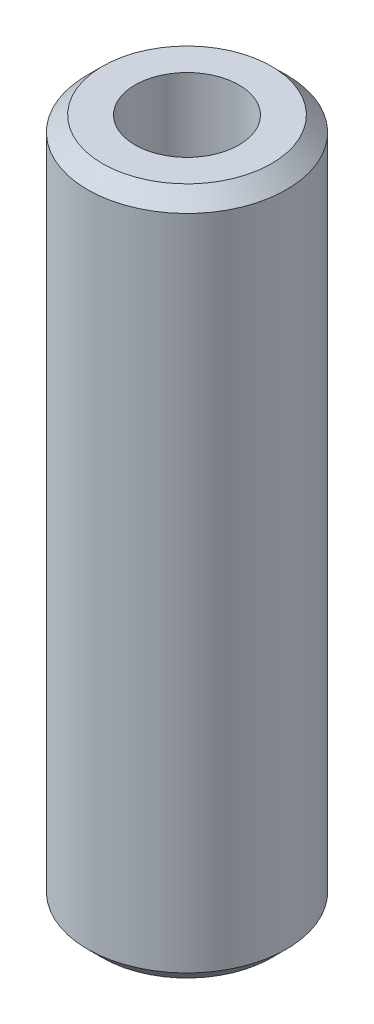
ISO-10303-21;
HEADER;
FILE_DESCRIPTION(('STEP AP214'),'2;1');
FILE_NAME('part.step','',(''),(''),'','','');
FILE_SCHEMA(('AUTOMOTIVE_DESIGN { 1 0 10303 214 1 1 1 1 }'));
ENDSEC;
DATA;
#1=APPLICATION_CONTEXT('core data for automotive mechanical design processes');
#2=APPLICATION_PROTOCOL_DEFINITION('international standard','automotive_design',2000,#1);
#3=PRODUCT_CONTEXT('',#1,'mechanical');
#4=PRODUCT('Part','Part','',(#3));
#5=PRODUCT_RELATED_PRODUCT_CATEGORY('part','',(#4));
#6=PRODUCT_DEFINITION_FORMATION('','',#4);
#7=PRODUCT_DEFINITION_CONTEXT('part definition',#1,'design');
#8=PRODUCT_DEFINITION('design','',#6,#7);
#9=PRODUCT_DEFINITION_SHAPE('','',#8);
#10=(LENGTH_UNIT() NAMED_UNIT(*) SI_UNIT(.MILLI.,.METRE.));
#11=(NAMED_UNIT(*) PLANE_ANGLE_UNIT() SI_UNIT($,.RADIAN.));
#12=(NAMED_UNIT(*) SI_UNIT($,.STERADIAN.) SOLID_ANGLE_UNIT());
#13=UNCERTAINTY_MEASURE_WITH_UNIT(LENGTH_MEASURE(1.E-05),#10,'distance_accuracy_value','');
#14=(GEOMETRIC_REPRESENTATION_CONTEXT(3) GLOBAL_UNCERTAINTY_ASSIGNED_CONTEXT((#13)) GLOBAL_UNIT_ASSIGNED_CONTEXT((#10,
#11,#12)) REPRESENTATION_CONTEXT('',''));
#15=CARTESIAN_POINT('',(0.,0.,0.));
#16=DIRECTION('',(0.,0.,1.));
#17=DIRECTION('',(1.,0.,0.));
#18=AXIS2_PLACEMENT_3D('',#15,#16,#17);
#19=CARTESIAN_POINT('',(0.,224.734660975205,0.));
#20=DIRECTION('',(0.,-1.,0.));
#21=DIRECTION('',(0.,0.,-1.));
#22=AXIS2_PLACEMENT_3D('',#19,#20,#21);
#23=CYLINDRICAL_SURFACE('',#22,32.5);
#24=CARTESIAN_POINT('',(0.,219.827706621433,0.));
#25=DIRECTION('',(0.,1.,0.));
#26=DIRECTION('',(0.,0.,1.));
#27=AXIS2_PLACEMENT_3D('',#24,#25,#26);
#28=CIRCLE('',#27,32.5);
#29=CARTESIAN_POINT('',(0.,219.827706621433,32.5));
#30=VERTEX_POINT('',#29);
#31=EDGE_CURVE('E50',#30,#30,#28,.F.);
#32=ORIENTED_EDGE('',*,*,#31,.T.);
#33=EDGE_LOOP('',(#32));
#34=FACE_BOUND('',#33,.T.);
#35=CARTESIAN_POINT('',(0.,4.90695435377206,0.));
#36=DIRECTION('',(0.,1.,0.));
#37=DIRECTION('',(0.,0.,1.));
#38=AXIS2_PLACEMENT_3D('',#35,#36,#37);
#39=CIRCLE('',#38,32.5);
#40=CARTESIAN_POINT('',(0.,4.90695435377206,32.5));
#41=VERTEX_POINT('',#40);
#42=EDGE_CURVE('E51',#41,#41,#39,.T.);
#43=ORIENTED_EDGE('',*,*,#42,.T.);
#44=EDGE_LOOP('',(#43));
#45=FACE_BOUND('',#44,.T.);
#46=ADVANCED_FACE('F39',(#34,#45),#23,.T.);
#47=CARTESIAN_POINT('',(0.,224.734660975205,0.));
#48=DIRECTION('',(0.,1.,0.));
#49=DIRECTION('',(0.,0.,1.));
#50=AXIS2_PLACEMENT_3D('',#47,#48,#49);
#51=PLANE('',#50);
#52=CARTESIAN_POINT('',(0.,224.734660975205,0.));
#53=DIRECTION('',(0.,1.,0.));
#54=DIRECTION('',(0.,0.,1.));
#55=AXIS2_PLACEMENT_3D('',#52,#53,#54);
#56=CIRCLE('',#55,27.593045646228);
#57=CARTESIAN_POINT('',(0.,224.734660975205,27.593045646228));
#58=VERTEX_POINT('',#57);
#59=EDGE_CURVE('E54',#58,#58,#56,.T.);
#60=ORIENTED_EDGE('',*,*,#59,.T.);
#61=EDGE_LOOP('',(#60));
#62=FACE_BOUND('',#61,.T.);
#63=CARTESIAN_POINT('',(0.,224.734660975205,0.));
#64=DIRECTION('',(0.,1.,0.));
#65=DIRECTION('',(0.,0.,1.));
#66=AXIS2_PLACEMENT_3D('',#63,#64,#65);
#67=CIRCLE('',#66,16.9886488983567);
#68=CARTESIAN_POINT('',(0.,224.734660975205,16.9886488983567));
#69=VERTEX_POINT('',#68);
#70=EDGE_CURVE('E58',#69,#69,#67,.T.);
#71=ORIENTED_EDGE('',*,*,#70,.F.);
#72=EDGE_LOOP('',(#71));
#73=FACE_BOUND('',#72,.T.);
#74=ADVANCED_FACE('F69',(#62,#73),#51,.T.);
#75=CARTESIAN_POINT('',(0.,0.,0.));
#76=DIRECTION('',(0.,1.,0.));
#77=DIRECTION('',(0.,0.,1.));
#78=AXIS2_PLACEMENT_3D('',#75,#76,#77);
#79=PLANE('',#78);
#80=CARTESIAN_POINT('',(0.,0.,0.));
#81=DIRECTION('',(0.,1.,0.));
#82=DIRECTION('',(0.,0.,1.));
#83=AXIS2_PLACEMENT_3D('',#80,#81,#82);
#84=CIRCLE('',#83,27.5930456462279);
#85=CARTESIAN_POINT('',(0.,0.,27.5930456462279));
#86=VERTEX_POINT('',#85);
#87=EDGE_CURVE('E10',#86,#86,#84,.F.);
#88=ORIENTED_EDGE('',*,*,#87,.T.);
#89=EDGE_LOOP('',(#88));
#90=FACE_BOUND('',#89,.T.);
#91=CARTESIAN_POINT('',(0.,0.,0.));
#92=DIRECTION('',(0.,1.,0.));
#93=DIRECTION('',(0.,0.,1.));
#94=AXIS2_PLACEMENT_3D('',#91,#92,#93);
#95=CIRCLE('',#94,16.9886488983567);
#96=CARTESIAN_POINT('',(0.,0.,16.9886488983567));
#97=VERTEX_POINT('',#96);
#98=EDGE_CURVE('E63',#97,#97,#95,.T.);
#99=ORIENTED_EDGE('',*,*,#98,.T.);
#100=EDGE_LOOP('',(#99));
#101=FACE_BOUND('',#100,.T.);
#102=ADVANCED_FACE('F75',(#90,#101),#79,.F.);
#103=CARTESIAN_POINT('',(0.,224.734660975205,0.));
#104=DIRECTION('',(0.,-1.,0.));
#105=DIRECTION('',(0.,0.,-1.));
#106=AXIS2_PLACEMENT_3D('',#103,#104,#105);
#107=CYLINDRICAL_SURFACE('',#106,16.9886488983567);
#108=ORIENTED_EDGE('',*,*,#70,.T.);
#109=EDGE_LOOP('',(#108));
#110=FACE_BOUND('',#109,.T.);
#111=ORIENTED_EDGE('',*,*,#98,.F.);
#112=EDGE_LOOP('',(#111));
#113=FACE_BOUND('',#112,.T.);
#114=ADVANCED_FACE('F70',(#110,#113),#107,.F.);
#115=CARTESIAN_POINT('',(0.,224.734660975205,0.));
#116=DIRECTION('',(0.,-1.,0.));
#117=DIRECTION('',(0.,0.,-1.));
#118=AXIS2_PLACEMENT_3D('',#115,#116,#117);
#119=CONICAL_SURFACE('',#118,27.593045646228,0.785398163397443);
#120=ORIENTED_EDGE('',*,*,#31,.F.);
#121=EDGE_LOOP('',(#120));
#122=FACE_BOUND('',#121,.T.);
#123=ORIENTED_EDGE('',*,*,#59,.F.);
#124=EDGE_LOOP('',(#123));
#125=FACE_BOUND('',#124,.T.);
#126=ADVANCED_FACE('F81',(#122,#125),#119,.T.);
#127=CARTESIAN_POINT('',(0.,4.90695435377206,0.));
#128=DIRECTION('',(0.,1.,0.));
#129=DIRECTION('',(0.,0.,1.));
#130=AXIS2_PLACEMENT_3D('',#127,#128,#129);
#131=CONICAL_SURFACE('',#130,32.5,0.785398163397451);
#132=ORIENTED_EDGE('',*,*,#87,.F.);
#133=EDGE_LOOP('',(#132));
#134=FACE_BOUND('',#133,.T.);
#135=ORIENTED_EDGE('',*,*,#42,.F.);
#136=EDGE_LOOP('',(#135));
#137=FACE_BOUND('',#136,.T.);
#138=ADVANCED_FACE('F45',(#134,#137),#131,.T.);
#139=CLOSED_SHELL('',(#46,#74,#102,#114,#126,#138));
#140=MANIFOLD_SOLID_BREP('B2',#139);
#141=ADVANCED_BREP_SHAPE_REPRESENTATION('',(#18,#140),#14);
#142=SHAPE_DEFINITION_REPRESENTATION(#9,#141);
ENDSEC;
END-ISO-10303-21;
